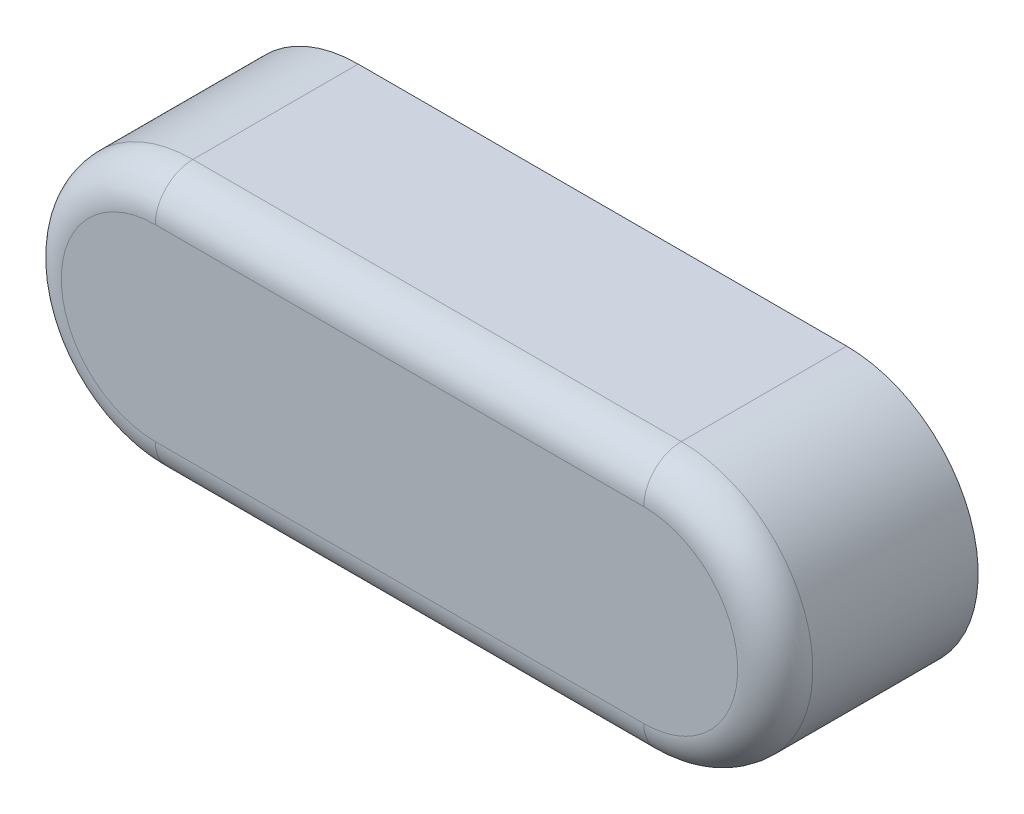
ISO-10303-21;
HEADER;
FILE_DESCRIPTION(('STEP AP214'),'2;1');
FILE_NAME('part.step','',(''),(''),'','','');
FILE_SCHEMA(('AUTOMOTIVE_DESIGN { 1 0 10303 214 1 1 1 1 }'));
ENDSEC;
DATA;
#1=APPLICATION_CONTEXT('core data for automotive mechanical design processes');
#2=APPLICATION_PROTOCOL_DEFINITION('international standard','automotive_design',2000,#1);
#3=PRODUCT_CONTEXT('',#1,'mechanical');
#4=PRODUCT('Part','Part','',(#3));
#5=PRODUCT_RELATED_PRODUCT_CATEGORY('part','',(#4));
#6=PRODUCT_DEFINITION_FORMATION('','',#4);
#7=PRODUCT_DEFINITION_CONTEXT('part definition',#1,'design');
#8=PRODUCT_DEFINITION('design','',#6,#7);
#9=PRODUCT_DEFINITION_SHAPE('','',#8);
#10=(LENGTH_UNIT() NAMED_UNIT(*) SI_UNIT(.MILLI.,.METRE.));
#11=(NAMED_UNIT(*) PLANE_ANGLE_UNIT() SI_UNIT($,.RADIAN.));
#12=(NAMED_UNIT(*) SI_UNIT($,.STERADIAN.) SOLID_ANGLE_UNIT());
#13=UNCERTAINTY_MEASURE_WITH_UNIT(LENGTH_MEASURE(1.E-05),#10,'distance_accuracy_value','');
#14=(GEOMETRIC_REPRESENTATION_CONTEXT(3) GLOBAL_UNCERTAINTY_ASSIGNED_CONTEXT((#13)) GLOBAL_UNIT_ASSIGNED_CONTEXT((#10,
#11,#12)) REPRESENTATION_CONTEXT('',''));
#15=CARTESIAN_POINT('',(0.,0.,0.));
#16=DIRECTION('',(0.,0.,1.));
#17=DIRECTION('',(1.,0.,0.));
#18=AXIS2_PLACEMENT_3D('',#15,#16,#17);
#19=CARTESIAN_POINT('',(-3.25,0.,2.7));
#20=DIRECTION('',(0.,0.,-1.));
#21=DIRECTION('',(-1.,0.,0.));
#22=AXIS2_PLACEMENT_3D('',#19,#20,#21);
#23=CYLINDRICAL_SURFACE('',#22,1.75);
#24=DIRECTION('',(0.,0.,-1.));
#25=VECTOR('',#24,1.);
#26=CARTESIAN_POINT('',(-3.25,-1.75,2.7));
#27=LINE('',#26,#25);
#28=CARTESIAN_POINT('',(-3.25,-1.75,2.2));
#29=VERTEX_POINT('',#28);
#30=CARTESIAN_POINT('',(-3.25,-1.75,0.));
#31=VERTEX_POINT('',#30);
#32=EDGE_CURVE('E87',#29,#31,#27,.T.);
#33=ORIENTED_EDGE('',*,*,#32,.F.);
#34=CARTESIAN_POINT('',(-3.25,0.,2.2));
#35=DIRECTION('',(0.,0.,1.));
#36=DIRECTION('',(1.,0.,0.));
#37=AXIS2_PLACEMENT_3D('',#34,#35,#36);
#38=CIRCLE('',#37,1.75);
#39=CARTESIAN_POINT('',(-3.25,1.75,2.2));
#40=VERTEX_POINT('',#39);
#41=EDGE_CURVE('E44',#29,#40,#38,.F.);
#42=ORIENTED_EDGE('',*,*,#41,.T.);
#43=DIRECTION('',(0.,0.,-1.));
#44=VECTOR('',#43,1.);
#45=CARTESIAN_POINT('',(-3.25,1.75,2.7));
#46=LINE('',#45,#44);
#47=CARTESIAN_POINT('',(-3.25,1.75,0.));
#48=VERTEX_POINT('',#47);
#49=EDGE_CURVE('E104',#40,#48,#46,.T.);
#50=ORIENTED_EDGE('',*,*,#49,.T.);
#51=CARTESIAN_POINT('',(-3.25,0.,0.));
#52=DIRECTION('',(0.,0.,1.));
#53=DIRECTION('',(1.,0.,0.));
#54=AXIS2_PLACEMENT_3D('',#51,#52,#53);
#55=CIRCLE('',#54,1.75);
#56=EDGE_CURVE('E100',#48,#31,#55,.T.);
#57=ORIENTED_EDGE('',*,*,#56,.T.);
#58=EDGE_LOOP('',(#33,#42,#50,#57));
#59=FACE_BOUND('',#58,.T.);
#60=ADVANCED_FACE('F35',(#59),#23,.T.);
#61=CARTESIAN_POINT('',(-3.25,-1.75,2.7));
#62=DIRECTION('',(0.,1.,0.));
#63=DIRECTION('',(0.,0.,1.));
#64=AXIS2_PLACEMENT_3D('',#61,#62,#63);
#65=PLANE('',#64);
#66=DIRECTION('',(0.,0.,-1.));
#67=VECTOR('',#66,1.);
#68=CARTESIAN_POINT('',(3.25,-1.75,2.7));
#69=LINE('',#68,#67);
#70=CARTESIAN_POINT('',(3.25,-1.75,2.2));
#71=VERTEX_POINT('',#70);
#72=CARTESIAN_POINT('',(3.25,-1.75,0.));
#73=VERTEX_POINT('',#72);
#74=EDGE_CURVE('E94',#71,#73,#69,.T.);
#75=ORIENTED_EDGE('',*,*,#74,.F.);
#76=DIRECTION('',(1.,0.,0.));
#77=VECTOR('',#76,1.);
#78=CARTESIAN_POINT('',(-3.25,-1.75,2.2));
#79=LINE('',#78,#77);
#80=EDGE_CURVE('E59',#71,#29,#79,.F.);
#81=ORIENTED_EDGE('',*,*,#80,.T.);
#82=ORIENTED_EDGE('',*,*,#32,.T.);
#83=DIRECTION('',(1.,0.,0.));
#84=VECTOR('',#83,1.);
#85=CARTESIAN_POINT('',(-3.25,-1.75,0.));
#86=LINE('',#85,#84);
#87=EDGE_CURVE('E90',#31,#73,#86,.T.);
#88=ORIENTED_EDGE('',*,*,#87,.T.);
#89=EDGE_LOOP('',(#75,#81,#82,#88));
#90=FACE_BOUND('',#89,.T.);
#91=ADVANCED_FACE('F89',(#90),#65,.F.);
#92=CARTESIAN_POINT('',(3.25,0.,2.7));
#93=DIRECTION('',(0.,0.,-1.));
#94=DIRECTION('',(-1.,0.,0.));
#95=AXIS2_PLACEMENT_3D('',#92,#93,#94);
#96=CYLINDRICAL_SURFACE('',#95,1.75);
#97=DIRECTION('',(0.,0.,-1.));
#98=VECTOR('',#97,1.);
#99=CARTESIAN_POINT('',(3.25,1.75,2.7));
#100=LINE('',#99,#98);
#101=CARTESIAN_POINT('',(3.25,1.75,2.2));
#102=VERTEX_POINT('',#101);
#103=CARTESIAN_POINT('',(3.25,1.75,0.));
#104=VERTEX_POINT('',#103);
#105=EDGE_CURVE('E114',#102,#104,#100,.T.);
#106=ORIENTED_EDGE('',*,*,#105,.F.);
#107=CARTESIAN_POINT('',(3.25,0.,2.2));
#108=DIRECTION('',(0.,0.,1.));
#109=DIRECTION('',(1.,0.,0.));
#110=AXIS2_PLACEMENT_3D('',#107,#108,#109);
#111=CIRCLE('',#110,1.75);
#112=EDGE_CURVE('E125',#102,#71,#111,.F.);
#113=ORIENTED_EDGE('',*,*,#112,.T.);
#114=ORIENTED_EDGE('',*,*,#74,.T.);
#115=CARTESIAN_POINT('',(3.25,0.,0.));
#116=DIRECTION('',(0.,0.,1.));
#117=DIRECTION('',(1.,0.,0.));
#118=AXIS2_PLACEMENT_3D('',#115,#116,#117);
#119=CIRCLE('',#118,1.75);
#120=EDGE_CURVE('E102',#73,#104,#119,.T.);
#121=ORIENTED_EDGE('',*,*,#120,.T.);
#122=EDGE_LOOP('',(#106,#113,#114,#121));
#123=FACE_BOUND('',#122,.T.);
#124=ADVANCED_FACE('F153',(#123),#96,.T.);
#125=CARTESIAN_POINT('',(-3.25,1.75,2.7));
#126=DIRECTION('',(0.,-1.,0.));
#127=DIRECTION('',(0.,0.,-1.));
#128=AXIS2_PLACEMENT_3D('',#125,#126,#127);
#129=PLANE('',#128);
#130=ORIENTED_EDGE('',*,*,#49,.F.);
#131=DIRECTION('',(-1.,0.,0.));
#132=VECTOR('',#131,1.);
#133=CARTESIAN_POINT('',(3.25,1.75,2.2));
#134=LINE('',#133,#132);
#135=EDGE_CURVE('E11',#40,#102,#134,.F.);
#136=ORIENTED_EDGE('',*,*,#135,.T.);
#137=ORIENTED_EDGE('',*,*,#105,.T.);
#138=DIRECTION('',(-1.,0.,0.));
#139=VECTOR('',#138,1.);
#140=CARTESIAN_POINT('',(-3.25,1.75,0.));
#141=LINE('',#140,#139);
#142=EDGE_CURVE('E111',#104,#48,#141,.T.);
#143=ORIENTED_EDGE('',*,*,#142,.T.);
#144=EDGE_LOOP('',(#130,#136,#137,#143));
#145=FACE_BOUND('',#144,.T.);
#146=ADVANCED_FACE('F155',(#145),#129,.F.);
#147=CARTESIAN_POINT('',(-3.25,0.,2.7));
#148=DIRECTION('',(0.,0.,1.));
#149=DIRECTION('',(1.,0.,0.));
#150=AXIS2_PLACEMENT_3D('',#147,#148,#149);
#151=PLANE('',#150);
#152=DIRECTION('',(1.,0.,0.));
#153=VECTOR('',#152,1.);
#154=CARTESIAN_POINT('',(3.25,-1.25,2.7));
#155=LINE('',#154,#153);
#156=CARTESIAN_POINT('',(-3.25,-1.25,2.7));
#157=VERTEX_POINT('',#156);
#158=CARTESIAN_POINT('',(3.25,-1.25,2.7));
#159=VERTEX_POINT('',#158);
#160=EDGE_CURVE('E120',#157,#159,#155,.T.);
#161=ORIENTED_EDGE('',*,*,#160,.T.);
#162=CARTESIAN_POINT('',(3.25,0.,2.7));
#163=DIRECTION('',(0.,0.,1.));
#164=DIRECTION('',(1.,0.,0.));
#165=AXIS2_PLACEMENT_3D('',#162,#163,#164);
#166=CIRCLE('',#165,1.25);
#167=CARTESIAN_POINT('',(3.25,1.25,2.7));
#168=VERTEX_POINT('',#167);
#169=EDGE_CURVE('E122',#159,#168,#166,.T.);
#170=ORIENTED_EDGE('',*,*,#169,.T.);
#171=DIRECTION('',(-1.,0.,0.));
#172=VECTOR('',#171,1.);
#173=CARTESIAN_POINT('',(-3.25,1.25,2.7));
#174=LINE('',#173,#172);
#175=CARTESIAN_POINT('',(-3.25,1.25,2.7));
#176=VERTEX_POINT('',#175);
#177=EDGE_CURVE('E93',#168,#176,#174,.T.);
#178=ORIENTED_EDGE('',*,*,#177,.T.);
#179=CARTESIAN_POINT('',(-3.25,0.,2.7));
#180=DIRECTION('',(0.,0.,1.));
#181=DIRECTION('',(1.,0.,0.));
#182=AXIS2_PLACEMENT_3D('',#179,#180,#181);
#183=CIRCLE('',#182,1.25);
#184=EDGE_CURVE('E118',#176,#157,#183,.T.);
#185=ORIENTED_EDGE('',*,*,#184,.T.);
#186=EDGE_LOOP('',(#161,#170,#178,#185));
#187=FACE_BOUND('',#186,.T.);
#188=ADVANCED_FACE('F145',(#187),#151,.T.);
#189=CARTESIAN_POINT('',(-3.25,0.,0.));
#190=DIRECTION('',(0.,0.,1.));
#191=DIRECTION('',(1.,0.,0.));
#192=AXIS2_PLACEMENT_3D('',#189,#190,#191);
#193=PLANE('',#192);
#194=ORIENTED_EDGE('',*,*,#56,.F.);
#195=ORIENTED_EDGE('',*,*,#142,.F.);
#196=ORIENTED_EDGE('',*,*,#120,.F.);
#197=ORIENTED_EDGE('',*,*,#87,.F.);
#198=EDGE_LOOP('',(#194,#195,#196,#197));
#199=FACE_BOUND('',#198,.T.);
#200=ADVANCED_FACE('F98',(#199),#193,.F.);
#201=CARTESIAN_POINT('',(-3.25,0.,2.2));
#202=DIRECTION('',(0.,0.,1.));
#203=DIRECTION('',(1.,0.,0.));
#204=AXIS2_PLACEMENT_3D('',#201,#202,#203);
#205=TOROIDAL_SURFACE('',#204,1.25,0.5);
#206=CARTESIAN_POINT('',(-3.25,1.25,2.2));
#207=DIRECTION('',(1.,0.,0.));
#208=DIRECTION('',(0.,0.,-1.));
#209=AXIS2_PLACEMENT_3D('',#206,#207,#208);
#210=CIRCLE('',#209,0.5);
#211=EDGE_CURVE('E108',#40,#176,#210,.T.);
#212=ORIENTED_EDGE('',*,*,#211,.F.);
#213=ORIENTED_EDGE('',*,*,#41,.F.);
#214=CARTESIAN_POINT('',(-3.25,-1.25,2.2));
#215=DIRECTION('',(1.,0.,0.));
#216=DIRECTION('',(0.,0.,-1.));
#217=AXIS2_PLACEMENT_3D('',#214,#215,#216);
#218=CIRCLE('',#217,0.5);
#219=EDGE_CURVE('E39',#157,#29,#218,.T.);
#220=ORIENTED_EDGE('',*,*,#219,.F.);
#221=ORIENTED_EDGE('',*,*,#184,.F.);
#222=EDGE_LOOP('',(#212,#213,#220,#221));
#223=FACE_BOUND('',#222,.T.);
#224=ADVANCED_FACE('F37',(#223),#205,.T.);
#225=CARTESIAN_POINT('',(-3.25,-1.25,2.2));
#226=DIRECTION('',(-1.,0.,0.));
#227=DIRECTION('',(0.,0.,1.));
#228=AXIS2_PLACEMENT_3D('',#225,#226,#227);
#229=CYLINDRICAL_SURFACE('',#228,0.5);
#230=ORIENTED_EDGE('',*,*,#219,.T.);
#231=ORIENTED_EDGE('',*,*,#80,.F.);
#232=CARTESIAN_POINT('',(3.25,-1.25,2.2));
#233=DIRECTION('',(1.,0.,0.));
#234=DIRECTION('',(0.,0.,-1.));
#235=AXIS2_PLACEMENT_3D('',#232,#233,#234);
#236=CIRCLE('',#235,0.5);
#237=EDGE_CURVE('E132',#159,#71,#236,.T.);
#238=ORIENTED_EDGE('',*,*,#237,.F.);
#239=ORIENTED_EDGE('',*,*,#160,.F.);
#240=EDGE_LOOP('',(#230,#231,#238,#239));
#241=FACE_BOUND('',#240,.T.);
#242=ADVANCED_FACE('F175',(#241),#229,.T.);
#243=CARTESIAN_POINT('',(-3.25,1.25,2.2));
#244=DIRECTION('',(1.,0.,0.));
#245=DIRECTION('',(0.,0.,-1.));
#246=AXIS2_PLACEMENT_3D('',#243,#244,#245);
#247=CYLINDRICAL_SURFACE('',#246,0.5);
#248=ORIENTED_EDGE('',*,*,#211,.T.);
#249=ORIENTED_EDGE('',*,*,#177,.F.);
#250=CARTESIAN_POINT('',(3.25,1.25,2.2));
#251=DIRECTION('',(1.,0.,0.));
#252=DIRECTION('',(0.,0.,-1.));
#253=AXIS2_PLACEMENT_3D('',#250,#251,#252);
#254=CIRCLE('',#253,0.5);
#255=EDGE_CURVE('E130',#102,#168,#254,.T.);
#256=ORIENTED_EDGE('',*,*,#255,.F.);
#257=ORIENTED_EDGE('',*,*,#135,.F.);
#258=EDGE_LOOP('',(#248,#249,#256,#257));
#259=FACE_BOUND('',#258,.T.);
#260=ADVANCED_FACE('F138',(#259),#247,.T.);
#261=CARTESIAN_POINT('',(3.25,0.,2.2));
#262=DIRECTION('',(0.,0.,1.));
#263=DIRECTION('',(1.,0.,0.));
#264=AXIS2_PLACEMENT_3D('',#261,#262,#263);
#265=TOROIDAL_SURFACE('',#264,1.25,0.5);
#266=ORIENTED_EDGE('',*,*,#237,.T.);
#267=ORIENTED_EDGE('',*,*,#112,.F.);
#268=ORIENTED_EDGE('',*,*,#255,.T.);
#269=ORIENTED_EDGE('',*,*,#169,.F.);
#270=EDGE_LOOP('',(#266,#267,#268,#269));
#271=FACE_BOUND('',#270,.T.);
#272=ADVANCED_FACE('F149',(#271),#265,.T.);
#273=CLOSED_SHELL('',(#60,#91,#124,#146,#188,#200,#224,#242,#260,#272));
#274=MANIFOLD_SOLID_BREP('B2',#273);
#275=ADVANCED_BREP_SHAPE_REPRESENTATION('',(#18,#274),#14);
#276=SHAPE_DEFINITION_REPRESENTATION(#9,#275);
ENDSEC;
END-ISO-10303-21;
